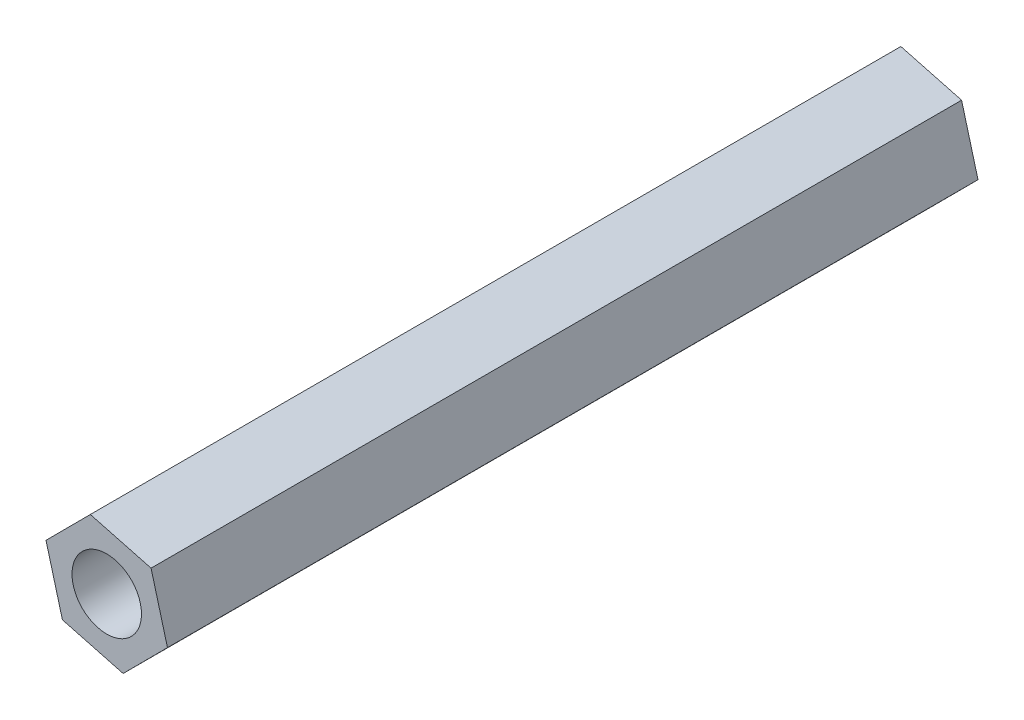
ISO-10303-21;
HEADER;
FILE_DESCRIPTION(('STEP AP214'),'2;1');
FILE_NAME('part.step','',(''),(''),'','','');
FILE_SCHEMA(('AUTOMOTIVE_DESIGN { 1 0 10303 214 1 1 1 1 }'));
ENDSEC;
DATA;
#1=APPLICATION_CONTEXT('core data for automotive mechanical design processes');
#2=APPLICATION_PROTOCOL_DEFINITION('international standard','automotive_design',2000,#1);
#3=PRODUCT_CONTEXT('',#1,'mechanical');
#4=PRODUCT('Part','Part','',(#3));
#5=PRODUCT_RELATED_PRODUCT_CATEGORY('part','',(#4));
#6=PRODUCT_DEFINITION_FORMATION('','',#4);
#7=PRODUCT_DEFINITION_CONTEXT('part definition',#1,'design');
#8=PRODUCT_DEFINITION('design','',#6,#7);
#9=PRODUCT_DEFINITION_SHAPE('','',#8);
#10=(LENGTH_UNIT() NAMED_UNIT(*) SI_UNIT(.MILLI.,.METRE.));
#11=(NAMED_UNIT(*) PLANE_ANGLE_UNIT() SI_UNIT($,.RADIAN.));
#12=(NAMED_UNIT(*) SI_UNIT($,.STERADIAN.) SOLID_ANGLE_UNIT());
#13=UNCERTAINTY_MEASURE_WITH_UNIT(LENGTH_MEASURE(1.E-05),#10,'distance_accuracy_value','');
#14=(GEOMETRIC_REPRESENTATION_CONTEXT(3) GLOBAL_UNCERTAINTY_ASSIGNED_CONTEXT((#13)) GLOBAL_UNIT_ASSIGNED_CONTEXT((#10,
#11,#12)) REPRESENTATION_CONTEXT('',''));
#15=CARTESIAN_POINT('',(0.,0.,0.));
#16=DIRECTION('',(0.,0.,1.));
#17=DIRECTION('',(1.,0.,0.));
#18=AXIS2_PLACEMENT_3D('',#15,#16,#17);
#19=CARTESIAN_POINT('',(0.,0.,35.));
#20=DIRECTION('',(0.,0.,1.));
#21=DIRECTION('',(1.,0.,0.));
#22=AXIS2_PLACEMENT_3D('',#19,#20,#21);
#23=PLANE('',#22);
#24=DIRECTION('',(-0.26109108901012,0.965314168154342,0.));
#25=VECTOR('',#24,1.);
#26=CARTESIAN_POINT('',(2.62272966989177,-0.696148268691921,35.));
#27=LINE('',#26,#25);
#28=CARTESIAN_POINT('',(2.62272966989177,-0.696148268691921,35.));
#29=VERTEX_POINT('',#28);
#30=CARTESIAN_POINT('',(1.91424692043364,1.92327638703948,35.));
#31=VERTEX_POINT('',#30);
#32=EDGE_CURVE('E146',#29,#31,#27,.T.);
#33=ORIENTED_EDGE('',*,*,#32,.T.);
#34=DIRECTION('',(-0.966532136759763,0.256545568292664,0.));
#35=VECTOR('',#34,1.);
#36=CARTESIAN_POINT('',(1.91424692043364,1.92327638703948,35.));
#37=LINE('',#36,#35);
#38=CARTESIAN_POINT('',(-0.708482749458123,2.61942465573141,35.));
#39=VERTEX_POINT('',#38);
#40=EDGE_CURVE('E94',#31,#39,#37,.T.);
#41=ORIENTED_EDGE('',*,*,#40,.T.);
#42=DIRECTION('',(-0.705441047749644,-0.708768599861679,0.));
#43=VECTOR('',#42,1.);
#44=CARTESIAN_POINT('',(-0.708482749458123,2.61942465573141,35.));
#45=LINE('',#44,#43);
#46=CARTESIAN_POINT('',(-2.62272966989177,0.69614826869192,35.));
#47=VERTEX_POINT('',#46);
#48=EDGE_CURVE('E107',#39,#47,#45,.T.);
#49=ORIENTED_EDGE('',*,*,#48,.T.);
#50=DIRECTION('',(0.26109108901012,-0.965314168154342,0.));
#51=VECTOR('',#50,1.);
#52=CARTESIAN_POINT('',(-2.62272966989177,0.69614826869192,35.));
#53=LINE('',#52,#51);
#54=CARTESIAN_POINT('',(-1.91424692043364,-1.92327638703949,35.));
#55=VERTEX_POINT('',#54);
#56=EDGE_CURVE('E101',#47,#55,#53,.T.);
#57=ORIENTED_EDGE('',*,*,#56,.T.);
#58=DIRECTION('',(0.966532136759764,-0.256545568292663,0.));
#59=VECTOR('',#58,1.);
#60=CARTESIAN_POINT('',(-1.91424692043364,-1.92327638703949,35.));
#61=LINE('',#60,#59);
#62=CARTESIAN_POINT('',(0.708482749458124,-2.61942465573141,35.));
#63=VERTEX_POINT('',#62);
#64=EDGE_CURVE('E105',#55,#63,#61,.T.);
#65=ORIENTED_EDGE('',*,*,#64,.T.);
#66=DIRECTION('',(0.705441047749644,0.708768599861679,0.));
#67=VECTOR('',#66,1.);
#68=CARTESIAN_POINT('',(0.708482749458124,-2.61942465573141,35.));
#69=LINE('',#68,#67);
#70=EDGE_CURVE('E57',#63,#29,#69,.T.);
#71=ORIENTED_EDGE('',*,*,#70,.T.);
#72=EDGE_LOOP('',(#33,#41,#49,#57,#65,#71));
#73=FACE_BOUND('',#72,.T.);
#74=CARTESIAN_POINT('',(0.,0.,35.));
#75=DIRECTION('',(0.,0.,1.));
#76=DIRECTION('',(1.,0.,0.));
#77=AXIS2_PLACEMENT_3D('',#74,#75,#76);
#78=CIRCLE('',#77,1.5);
#79=CARTESIAN_POINT('',(1.5,0.,35.));
#80=VERTEX_POINT('',#79);
#81=EDGE_CURVE('E134',#80,#80,#78,.T.);
#82=ORIENTED_EDGE('',*,*,#81,.F.);
#83=EDGE_LOOP('',(#82));
#84=FACE_BOUND('',#83,.T.);
#85=ADVANCED_FACE('F39',(#73,#84),#23,.T.);
#86=CARTESIAN_POINT('',(0.,0.,0.));
#87=DIRECTION('',(0.,0.,1.));
#88=DIRECTION('',(1.,0.,0.));
#89=AXIS2_PLACEMENT_3D('',#86,#87,#88);
#90=PLANE('',#89);
#91=DIRECTION('',(-0.26109108901012,0.965314168154342,0.));
#92=VECTOR('',#91,1.);
#93=CARTESIAN_POINT('',(2.62272966989177,-0.696148268691921,0.));
#94=LINE('',#93,#92);
#95=CARTESIAN_POINT('',(2.62272966989177,-0.696148268691921,0.));
#96=VERTEX_POINT('',#95);
#97=CARTESIAN_POINT('',(1.91424692043364,1.92327638703948,0.));
#98=VERTEX_POINT('',#97);
#99=EDGE_CURVE('E129',#96,#98,#94,.T.);
#100=ORIENTED_EDGE('',*,*,#99,.F.);
#101=DIRECTION('',(0.705441047749644,0.708768599861679,0.));
#102=VECTOR('',#101,1.);
#103=CARTESIAN_POINT('',(0.708482749458124,-2.61942465573141,0.));
#104=LINE('',#103,#102);
#105=CARTESIAN_POINT('',(0.708482749458124,-2.61942465573141,0.));
#106=VERTEX_POINT('',#105);
#107=EDGE_CURVE('E86',#106,#96,#104,.T.);
#108=ORIENTED_EDGE('',*,*,#107,.F.);
#109=DIRECTION('',(0.966532136759764,-0.256545568292663,0.));
#110=VECTOR('',#109,1.);
#111=CARTESIAN_POINT('',(-1.91424692043364,-1.92327638703949,0.));
#112=LINE('',#111,#110);
#113=CARTESIAN_POINT('',(-1.91424692043364,-1.92327638703949,0.));
#114=VERTEX_POINT('',#113);
#115=EDGE_CURVE('E80',#114,#106,#112,.T.);
#116=ORIENTED_EDGE('',*,*,#115,.F.);
#117=DIRECTION('',(0.26109108901012,-0.965314168154342,0.));
#118=VECTOR('',#117,1.);
#119=CARTESIAN_POINT('',(-2.62272966989177,0.69614826869192,0.));
#120=LINE('',#119,#118);
#121=CARTESIAN_POINT('',(-2.62272966989177,0.69614826869192,0.));
#122=VERTEX_POINT('',#121);
#123=EDGE_CURVE('E116',#122,#114,#120,.T.);
#124=ORIENTED_EDGE('',*,*,#123,.F.);
#125=DIRECTION('',(-0.705441047749644,-0.708768599861679,0.));
#126=VECTOR('',#125,1.);
#127=CARTESIAN_POINT('',(-0.708482749458123,2.61942465573141,0.));
#128=LINE('',#127,#126);
#129=CARTESIAN_POINT('',(-0.708482749458123,2.61942465573141,0.));
#130=VERTEX_POINT('',#129);
#131=EDGE_CURVE('E137',#130,#122,#128,.T.);
#132=ORIENTED_EDGE('',*,*,#131,.F.);
#133=DIRECTION('',(-0.966532136759763,0.256545568292664,0.));
#134=VECTOR('',#133,1.);
#135=CARTESIAN_POINT('',(1.91424692043364,1.92327638703948,0.));
#136=LINE('',#135,#134);
#137=EDGE_CURVE('E133',#98,#130,#136,.T.);
#138=ORIENTED_EDGE('',*,*,#137,.F.);
#139=EDGE_LOOP('',(#100,#108,#116,#124,#132,#138));
#140=FACE_BOUND('',#139,.T.);
#141=CARTESIAN_POINT('',(0.,0.,0.));
#142=DIRECTION('',(0.,0.,1.));
#143=DIRECTION('',(1.,0.,0.));
#144=AXIS2_PLACEMENT_3D('',#141,#142,#143);
#145=CIRCLE('',#144,1.5);
#146=CARTESIAN_POINT('',(1.5,0.,0.));
#147=VERTEX_POINT('',#146);
#148=EDGE_CURVE('E243',#147,#147,#145,.T.);
#149=ORIENTED_EDGE('',*,*,#148,.T.);
#150=EDGE_LOOP('',(#149));
#151=FACE_BOUND('',#150,.T.);
#152=ADVANCED_FACE('F159',(#140,#151),#90,.F.);
#153=CARTESIAN_POINT('',(2.62272966989177,-0.696148268691921,35.));
#154=DIRECTION('',(-0.965314168154342,-0.26109108901012,0.));
#155=DIRECTION('',(0.26109108901012,-0.965314168154342,0.));
#156=AXIS2_PLACEMENT_3D('',#153,#154,#155);
#157=PLANE('',#156);
#158=ORIENTED_EDGE('',*,*,#99,.T.);
#159=DIRECTION('',(0.,0.,-1.));
#160=VECTOR('',#159,1.);
#161=CARTESIAN_POINT('',(1.91424692043364,1.92327638703948,35.));
#162=LINE('',#161,#160);
#163=EDGE_CURVE('E11',#31,#98,#162,.T.);
#164=ORIENTED_EDGE('',*,*,#163,.F.);
#165=ORIENTED_EDGE('',*,*,#32,.F.);
#166=DIRECTION('',(0.,0.,-1.));
#167=VECTOR('',#166,1.);
#168=CARTESIAN_POINT('',(2.62272966989177,-0.696148268691921,35.));
#169=LINE('',#168,#167);
#170=EDGE_CURVE('E125',#29,#96,#169,.T.);
#171=ORIENTED_EDGE('',*,*,#170,.T.);
#172=EDGE_LOOP('',(#158,#164,#165,#171));
#173=FACE_BOUND('',#172,.T.);
#174=ADVANCED_FACE('F41',(#173),#157,.F.);
#175=CARTESIAN_POINT('',(1.91424692043364,1.92327638703948,35.));
#176=DIRECTION('',(-0.256545568292664,-0.966532136759763,0.));
#177=DIRECTION('',(0.966532136759764,-0.256545568292664,0.));
#178=AXIS2_PLACEMENT_3D('',#175,#176,#177);
#179=PLANE('',#178);
#180=ORIENTED_EDGE('',*,*,#137,.T.);
#181=DIRECTION('',(0.,0.,-1.));
#182=VECTOR('',#181,1.);
#183=CARTESIAN_POINT('',(-0.708482749458123,2.61942465573141,35.));
#184=LINE('',#183,#182);
#185=EDGE_CURVE('E49',#39,#130,#184,.T.);
#186=ORIENTED_EDGE('',*,*,#185,.F.);
#187=ORIENTED_EDGE('',*,*,#40,.F.);
#188=ORIENTED_EDGE('',*,*,#163,.T.);
#189=EDGE_LOOP('',(#180,#186,#187,#188));
#190=FACE_BOUND('',#189,.T.);
#191=ADVANCED_FACE('F184',(#190),#179,.F.);
#192=CARTESIAN_POINT('',(-0.708482749458123,2.61942465573141,35.));
#193=DIRECTION('',(0.708768599861679,-0.705441047749644,0.));
#194=DIRECTION('',(0.705441047749644,0.708768599861679,0.));
#195=AXIS2_PLACEMENT_3D('',#192,#193,#194);
#196=PLANE('',#195);
#197=ORIENTED_EDGE('',*,*,#131,.T.);
#198=DIRECTION('',(0.,0.,-1.));
#199=VECTOR('',#198,1.);
#200=CARTESIAN_POINT('',(-2.62272966989177,0.69614826869192,35.));
#201=LINE('',#200,#199);
#202=EDGE_CURVE('E118',#47,#122,#201,.T.);
#203=ORIENTED_EDGE('',*,*,#202,.F.);
#204=ORIENTED_EDGE('',*,*,#48,.F.);
#205=ORIENTED_EDGE('',*,*,#185,.T.);
#206=EDGE_LOOP('',(#197,#203,#204,#205));
#207=FACE_BOUND('',#206,.T.);
#208=ADVANCED_FACE('F156',(#207),#196,.F.);
#209=CARTESIAN_POINT('',(-2.62272966989177,0.69614826869192,35.));
#210=DIRECTION('',(0.965314168154342,0.26109108901012,0.));
#211=DIRECTION('',(-0.26109108901012,0.965314168154342,0.));
#212=AXIS2_PLACEMENT_3D('',#209,#210,#211);
#213=PLANE('',#212);
#214=ORIENTED_EDGE('',*,*,#123,.T.);
#215=DIRECTION('',(0.,0.,-1.));
#216=VECTOR('',#215,1.);
#217=CARTESIAN_POINT('',(-1.91424692043364,-1.92327638703949,35.));
#218=LINE('',#217,#216);
#219=EDGE_CURVE('E113',#55,#114,#218,.T.);
#220=ORIENTED_EDGE('',*,*,#219,.F.);
#221=ORIENTED_EDGE('',*,*,#56,.F.);
#222=ORIENTED_EDGE('',*,*,#202,.T.);
#223=EDGE_LOOP('',(#214,#220,#221,#222));
#224=FACE_BOUND('',#223,.T.);
#225=ADVANCED_FACE('F114',(#224),#213,.F.);
#226=CARTESIAN_POINT('',(-1.91424692043364,-1.92327638703949,35.));
#227=DIRECTION('',(0.256545568292663,0.966532136759764,0.));
#228=DIRECTION('',(-0.966532136759764,0.256545568292663,0.));
#229=AXIS2_PLACEMENT_3D('',#226,#227,#228);
#230=PLANE('',#229);
#231=ORIENTED_EDGE('',*,*,#115,.T.);
#232=DIRECTION('',(0.,0.,-1.));
#233=VECTOR('',#232,1.);
#234=CARTESIAN_POINT('',(0.708482749458124,-2.61942465573141,35.));
#235=LINE('',#234,#233);
#236=EDGE_CURVE('E119',#63,#106,#235,.T.);
#237=ORIENTED_EDGE('',*,*,#236,.F.);
#238=ORIENTED_EDGE('',*,*,#64,.F.);
#239=ORIENTED_EDGE('',*,*,#219,.T.);
#240=EDGE_LOOP('',(#231,#237,#238,#239));
#241=FACE_BOUND('',#240,.T.);
#242=ADVANCED_FACE('F121',(#241),#230,.F.);
#243=CARTESIAN_POINT('',(0.708482749458124,-2.61942465573141,35.));
#244=DIRECTION('',(-0.708768599861679,0.705441047749644,0.));
#245=DIRECTION('',(-0.705441047749644,-0.708768599861679,0.));
#246=AXIS2_PLACEMENT_3D('',#243,#244,#245);
#247=PLANE('',#246);
#248=ORIENTED_EDGE('',*,*,#107,.T.);
#249=ORIENTED_EDGE('',*,*,#170,.F.);
#250=ORIENTED_EDGE('',*,*,#70,.F.);
#251=ORIENTED_EDGE('',*,*,#236,.T.);
#252=EDGE_LOOP('',(#248,#249,#250,#251));
#253=FACE_BOUND('',#252,.T.);
#254=ADVANCED_FACE('F164',(#253),#247,.F.);
#255=CARTESIAN_POINT('',(0.,0.,35.));
#256=DIRECTION('',(0.,0.,-1.));
#257=DIRECTION('',(-1.,0.,0.));
#258=AXIS2_PLACEMENT_3D('',#255,#256,#257);
#259=CYLINDRICAL_SURFACE('',#258,1.5);
#260=ORIENTED_EDGE('',*,*,#81,.T.);
#261=EDGE_LOOP('',(#260));
#262=FACE_BOUND('',#261,.T.);
#263=ORIENTED_EDGE('',*,*,#148,.F.);
#264=EDGE_LOOP('',(#263));
#265=FACE_BOUND('',#264,.T.);
#266=ADVANCED_FACE('F166',(#262,#265),#259,.F.);
#267=CLOSED_SHELL('',(#85,#152,#174,#191,#208,#225,#242,#254,#266));
#268=MANIFOLD_SOLID_BREP('B2',#267);
#269=ADVANCED_BREP_SHAPE_REPRESENTATION('',(#18,#268),#14);
#270=SHAPE_DEFINITION_REPRESENTATION(#9,#269);
ENDSEC;
END-ISO-10303-21;
